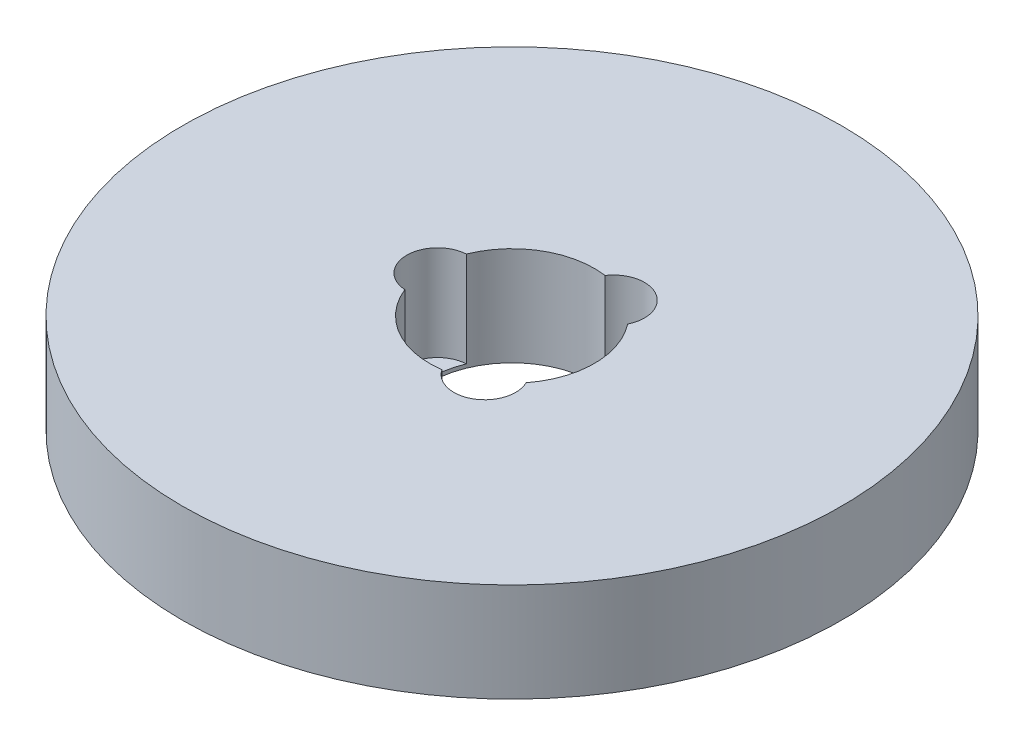
ISO-10303-21;
HEADER;
FILE_DESCRIPTION(('STEP AP214'),'2;1');
FILE_NAME('part.step','',(''),(''),'','','');
FILE_SCHEMA(('AUTOMOTIVE_DESIGN { 1 0 10303 214 1 1 1 1 }'));
ENDSEC;
DATA;
#1=APPLICATION_CONTEXT('core data for automotive mechanical design processes');
#2=APPLICATION_PROTOCOL_DEFINITION('international standard','automotive_design',2000,#1);
#3=PRODUCT_CONTEXT('',#1,'mechanical');
#4=PRODUCT('Part','Part','',(#3));
#5=PRODUCT_RELATED_PRODUCT_CATEGORY('part','',(#4));
#6=PRODUCT_DEFINITION_FORMATION('','',#4);
#7=PRODUCT_DEFINITION_CONTEXT('part definition',#1,'design');
#8=PRODUCT_DEFINITION('design','',#6,#7);
#9=PRODUCT_DEFINITION_SHAPE('','',#8);
#10=(LENGTH_UNIT() NAMED_UNIT(*) SI_UNIT(.MILLI.,.METRE.));
#11=(NAMED_UNIT(*) PLANE_ANGLE_UNIT() SI_UNIT($,.RADIAN.));
#12=(NAMED_UNIT(*) SI_UNIT($,.STERADIAN.) SOLID_ANGLE_UNIT());
#13=UNCERTAINTY_MEASURE_WITH_UNIT(LENGTH_MEASURE(1.E-05),#10,'distance_accuracy_value','');
#14=(GEOMETRIC_REPRESENTATION_CONTEXT(3) GLOBAL_UNCERTAINTY_ASSIGNED_CONTEXT((#13)) GLOBAL_UNIT_ASSIGNED_CONTEXT((#10,
#11,#12)) REPRESENTATION_CONTEXT('',''));
#15=CARTESIAN_POINT('',(0.,0.,0.));
#16=DIRECTION('',(0.,0.,1.));
#17=DIRECTION('',(1.,0.,0.));
#18=AXIS2_PLACEMENT_3D('',#15,#16,#17);
#19=CARTESIAN_POINT('',(0.,9.,0.));
#20=DIRECTION('',(0.,-1.,0.));
#21=DIRECTION('',(0.,0.,-1.));
#22=AXIS2_PLACEMENT_3D('',#19,#20,#21);
#23=CYLINDRICAL_SURFACE('',#22,30.);
#24=CARTESIAN_POINT('',(0.,9.,0.));
#25=DIRECTION('',(0.,1.,0.));
#26=DIRECTION('',(0.,0.,1.));
#27=AXIS2_PLACEMENT_3D('',#24,#25,#26);
#28=CIRCLE('',#27,30.);
#29=CARTESIAN_POINT('',(0.,9.,30.));
#30=VERTEX_POINT('',#29);
#31=EDGE_CURVE('E130',#30,#30,#28,.T.);
#32=ORIENTED_EDGE('',*,*,#31,.F.);
#33=EDGE_LOOP('',(#32));
#34=FACE_BOUND('',#33,.T.);
#35=CARTESIAN_POINT('',(0.,0.,0.));
#36=DIRECTION('',(0.,1.,0.));
#37=DIRECTION('',(0.,0.,1.));
#38=AXIS2_PLACEMENT_3D('',#35,#36,#37);
#39=CIRCLE('',#38,30.);
#40=CARTESIAN_POINT('',(0.,0.,30.));
#41=VERTEX_POINT('',#40);
#42=EDGE_CURVE('E117',#41,#41,#39,.T.);
#43=ORIENTED_EDGE('',*,*,#42,.T.);
#44=EDGE_LOOP('',(#43));
#45=FACE_BOUND('',#44,.T.);
#46=ADVANCED_FACE('F39',(#34,#45),#23,.T.);
#47=CARTESIAN_POINT('',(0.,9.,0.));
#48=DIRECTION('',(0.,1.,0.));
#49=DIRECTION('',(0.,0.,1.));
#50=AXIS2_PLACEMENT_3D('',#47,#48,#49);
#51=PLANE('',#50);
#52=CARTESIAN_POINT('',(3.3843474534861,9.,5.86186173990421));
#53=DIRECTION('',(0.,1.,0.));
#54=DIRECTION('',(0.866025403784436,0.,-0.500000000000004));
#55=AXIS2_PLACEMENT_3D('',#52,#53,#54);
#56=CIRCLE('',#55,2.81327656806787);
#57=CARTESIAN_POINT('',(1.04640352156776,9.,7.42664390354422));
#58=VERTEX_POINT('',#57);
#59=CARTESIAN_POINT('',(5.90846052454629,9.,4.61953398405923));
#60=VERTEX_POINT('',#59);
#61=EDGE_CURVE('E148',#58,#60,#56,.T.);
#62=ORIENTED_EDGE('',*,*,#61,.F.);
#63=CARTESIAN_POINT('',(0.,9.,0.));
#64=DIRECTION('',(0.,1.,0.));
#65=DIRECTION('',(0.,0.,1.));
#66=AXIS2_PLACEMENT_3D('',#63,#64,#65);
#67=CIRCLE('',#66,7.5);
#68=CARTESIAN_POINT('',(-6.95486404611399,9.,2.80710991948497));
#69=VERTEX_POINT('',#68);
#70=EDGE_CURVE('E113',#69,#58,#67,.T.);
#71=ORIENTED_EDGE('',*,*,#70,.F.);
#72=CARTESIAN_POINT('',(-6.76869490697215,9.,0.));
#73=DIRECTION('',(0.,1.,0.));
#74=DIRECTION('',(0.,0.,1.));
#75=AXIS2_PLACEMENT_3D('',#72,#73,#74);
#76=CIRCLE('',#75,2.81327656806787);
#77=CARTESIAN_POINT('',(-6.95486404611399,9.,-2.80710991948497));
#78=VERTEX_POINT('',#77);
#79=EDGE_CURVE('E125',#78,#69,#76,.T.);
#80=ORIENTED_EDGE('',*,*,#79,.F.);
#81=CARTESIAN_POINT('',(1.04640352156765,9.,-7.42664390354424));
#82=VERTEX_POINT('',#81);
#83=EDGE_CURVE('E107',#82,#78,#67,.T.);
#84=ORIENTED_EDGE('',*,*,#83,.F.);
#85=CARTESIAN_POINT('',(3.38434745348602,9.,-5.86186173990426));
#86=DIRECTION('',(0.,1.,0.));
#87=DIRECTION('',(-0.866025403784443,0.,-0.499999999999992));
#88=AXIS2_PLACEMENT_3D('',#85,#86,#87);
#89=CIRCLE('',#88,2.81327656806787);
#90=CARTESIAN_POINT('',(5.90846052454623,9.,-4.61953398405932));
#91=VERTEX_POINT('',#90);
#92=EDGE_CURVE('E95',#91,#82,#89,.T.);
#93=ORIENTED_EDGE('',*,*,#92,.F.);
#94=EDGE_CURVE('E106',#60,#91,#67,.T.);
#95=ORIENTED_EDGE('',*,*,#94,.F.);
#96=EDGE_LOOP('',(#62,#71,#80,#84,#93,#95));
#97=FACE_BOUND('',#96,.T.);
#98=ORIENTED_EDGE('',*,*,#31,.T.);
#99=EDGE_LOOP('',(#98));
#100=FACE_BOUND('',#99,.T.);
#101=ADVANCED_FACE('F102',(#97,#100),#51,.T.);
#102=CARTESIAN_POINT('',(0.,0.,0.));
#103=DIRECTION('',(0.,1.,0.));
#104=DIRECTION('',(0.,0.,1.));
#105=AXIS2_PLACEMENT_3D('',#102,#103,#104);
#106=PLANE('',#105);
#107=CARTESIAN_POINT('',(0.,0.,0.));
#108=DIRECTION('',(0.,1.,0.));
#109=DIRECTION('',(0.,0.,1.));
#110=AXIS2_PLACEMENT_3D('',#107,#108,#109);
#111=CIRCLE('',#110,7.5);
#112=CARTESIAN_POINT('',(0.,0.,7.5));
#113=VERTEX_POINT('',#112);
#114=EDGE_CURVE('E118',#113,#113,#111,.T.);
#115=ORIENTED_EDGE('',*,*,#114,.T.);
#116=EDGE_LOOP('',(#115));
#117=FACE_BOUND('',#116,.T.);
#118=ORIENTED_EDGE('',*,*,#42,.F.);
#119=EDGE_LOOP('',(#118));
#120=FACE_BOUND('',#119,.T.);
#121=ADVANCED_FACE('F161',(#117,#120),#106,.F.);
#122=CARTESIAN_POINT('',(0.,9.,0.));
#123=DIRECTION('',(0.,-1.,0.));
#124=DIRECTION('',(0.,0.,-1.));
#125=AXIS2_PLACEMENT_3D('',#122,#123,#124);
#126=CYLINDRICAL_SURFACE('',#125,7.5);
#127=DIRECTION('',(0.,1.,0.));
#128=VECTOR('',#127,1.);
#129=CARTESIAN_POINT('',(1.04640352156776,4.67171512583088,7.42664390354423));
#130=LINE('',#129,#128);
#131=CARTESIAN_POINT('',(1.04640352156776,0.343430251661754,7.42664390354422));
#132=VERTEX_POINT('',#131);
#133=EDGE_CURVE('E11',#132,#58,#130,.T.);
#134=ORIENTED_EDGE('',*,*,#133,.F.);
#135=CARTESIAN_POINT('',(0.,0.343430251661754,0.));
#136=DIRECTION('',(0.,1.,0.));
#137=DIRECTION('',(0.,0.,1.));
#138=AXIS2_PLACEMENT_3D('',#135,#136,#137);
#139=CIRCLE('',#138,7.5);
#140=CARTESIAN_POINT('',(5.90846052454629,0.343430251661754,4.61953398405923));
#141=VERTEX_POINT('',#140);
#142=EDGE_CURVE('E100',#132,#141,#139,.T.);
#143=ORIENTED_EDGE('',*,*,#142,.T.);
#144=DIRECTION('',(0.,1.,0.));
#145=VECTOR('',#144,1.);
#146=CARTESIAN_POINT('',(5.90846052454629,4.67171512583088,4.61953398405923));
#147=LINE('',#146,#145);
#148=EDGE_CURVE('E46',#60,#141,#147,.F.);
#149=ORIENTED_EDGE('',*,*,#148,.F.);
#150=ORIENTED_EDGE('',*,*,#94,.T.);
#151=DIRECTION('',(0.,1.,0.));
#152=VECTOR('',#151,1.);
#153=CARTESIAN_POINT('',(5.90846052454623,4.67171512583088,-4.61953398405932));
#154=LINE('',#153,#152);
#155=CARTESIAN_POINT('',(5.90846052454623,0.343430251661754,-4.61953398405932));
#156=VERTEX_POINT('',#155);
#157=EDGE_CURVE('E90',#156,#91,#154,.T.);
#158=ORIENTED_EDGE('',*,*,#157,.F.);
#159=CARTESIAN_POINT('',(0.,0.343430251661754,0.));
#160=DIRECTION('',(0.,1.,0.));
#161=DIRECTION('',(0.,0.,1.));
#162=AXIS2_PLACEMENT_3D('',#159,#160,#161);
#163=CIRCLE('',#162,7.5);
#164=CARTESIAN_POINT('',(1.04640352156765,0.343430251661754,-7.42664390354424));
#165=VERTEX_POINT('',#164);
#166=EDGE_CURVE('E143',#156,#165,#163,.T.);
#167=ORIENTED_EDGE('',*,*,#166,.T.);
#168=DIRECTION('',(0.,1.,0.));
#169=VECTOR('',#168,1.);
#170=CARTESIAN_POINT('',(1.04640352156765,4.67171512583088,-7.42664390354424));
#171=LINE('',#170,#169);
#172=EDGE_CURVE('E98',#82,#165,#171,.F.);
#173=ORIENTED_EDGE('',*,*,#172,.F.);
#174=ORIENTED_EDGE('',*,*,#83,.T.);
#175=DIRECTION('',(0.,1.,0.));
#176=VECTOR('',#175,1.);
#177=CARTESIAN_POINT('',(-6.95486404611399,4.67171512583088,-2.80710991948497));
#178=LINE('',#177,#176);
#179=CARTESIAN_POINT('',(-6.95486404611399,0.343430251661754,-2.80710991948497));
#180=VERTEX_POINT('',#179);
#181=EDGE_CURVE('E137',#180,#78,#178,.T.);
#182=ORIENTED_EDGE('',*,*,#181,.F.);
#183=CARTESIAN_POINT('',(0.,0.343430251661754,0.));
#184=DIRECTION('',(0.,1.,0.));
#185=DIRECTION('',(0.,0.,1.));
#186=AXIS2_PLACEMENT_3D('',#183,#184,#185);
#187=CIRCLE('',#186,7.5);
#188=CARTESIAN_POINT('',(-6.95486404611399,0.343430251661754,2.80710991948497));
#189=VERTEX_POINT('',#188);
#190=EDGE_CURVE('E128',#180,#189,#187,.T.);
#191=ORIENTED_EDGE('',*,*,#190,.T.);
#192=DIRECTION('',(0.,1.,0.));
#193=VECTOR('',#192,1.);
#194=CARTESIAN_POINT('',(-6.95486404611399,4.67171512583088,2.80710991948497));
#195=LINE('',#194,#193);
#196=EDGE_CURVE('E134',#69,#189,#195,.F.);
#197=ORIENTED_EDGE('',*,*,#196,.F.);
#198=ORIENTED_EDGE('',*,*,#70,.T.);
#199=EDGE_LOOP('',(#134,#143,#149,#150,#158,#167,#173,#174,#182,#191,#197,#198));
#200=FACE_BOUND('',#199,.T.);
#201=ORIENTED_EDGE('',*,*,#114,.F.);
#202=EDGE_LOOP('',(#201));
#203=FACE_BOUND('',#202,.T.);
#204=ADVANCED_FACE('F115',(#200,#203),#126,.F.);
#205=CARTESIAN_POINT('',(-6.76869490697215,0.343430251661754,0.));
#206=DIRECTION('',(0.,1.,0.));
#207=DIRECTION('',(0.,0.,1.));
#208=AXIS2_PLACEMENT_3D('',#205,#206,#207);
#209=CYLINDRICAL_SURFACE('',#208,2.81327656806787);
#210=ORIENTED_EDGE('',*,*,#181,.T.);
#211=ORIENTED_EDGE('',*,*,#79,.T.);
#212=ORIENTED_EDGE('',*,*,#196,.T.);
#213=CARTESIAN_POINT('',(-6.76869490697215,0.343430251661754,0.));
#214=DIRECTION('',(0.,1.,0.));
#215=DIRECTION('',(0.,0.,1.));
#216=AXIS2_PLACEMENT_3D('',#213,#214,#215);
#217=CIRCLE('',#216,2.81327656806787);
#218=EDGE_CURVE('E127',#180,#189,#217,.T.);
#219=ORIENTED_EDGE('',*,*,#218,.F.);
#220=EDGE_LOOP('',(#210,#211,#212,#219));
#221=FACE_BOUND('',#220,.T.);
#222=ADVANCED_FACE('F175',(#221),#209,.F.);
#223=CARTESIAN_POINT('',(-6.76869490697215,0.343430251661754,0.));
#224=DIRECTION('',(0.,1.,0.));
#225=DIRECTION('',(0.,0.,1.));
#226=AXIS2_PLACEMENT_3D('',#223,#224,#225);
#227=PLANE('',#226);
#228=ORIENTED_EDGE('',*,*,#218,.T.);
#229=ORIENTED_EDGE('',*,*,#190,.F.);
#230=EDGE_LOOP('',(#228,#229));
#231=FACE_BOUND('',#230,.T.);
#232=ADVANCED_FACE('F176',(#231),#227,.T.);
#233=CARTESIAN_POINT('',(3.38434745348602,0.343430251661754,-5.86186173990426));
#234=DIRECTION('',(0.,1.,0.));
#235=DIRECTION('',(0.,0.,1.));
#236=AXIS2_PLACEMENT_3D('',#233,#234,#235);
#237=CYLINDRICAL_SURFACE('',#236,2.81327656806787);
#238=ORIENTED_EDGE('',*,*,#157,.T.);
#239=ORIENTED_EDGE('',*,*,#92,.T.);
#240=ORIENTED_EDGE('',*,*,#172,.T.);
#241=CARTESIAN_POINT('',(3.38434745348602,0.343430251661754,-5.86186173990426));
#242=DIRECTION('',(0.,1.,0.));
#243=DIRECTION('',(-0.866025403784443,0.,-0.499999999999992));
#244=AXIS2_PLACEMENT_3D('',#241,#242,#243);
#245=CIRCLE('',#244,2.81327656806787);
#246=EDGE_CURVE('E56',#156,#165,#245,.T.);
#247=ORIENTED_EDGE('',*,*,#246,.F.);
#248=EDGE_LOOP('',(#238,#239,#240,#247));
#249=FACE_BOUND('',#248,.T.);
#250=ADVANCED_FACE('F93',(#249),#237,.F.);
#251=CARTESIAN_POINT('',(3.38434745348602,0.343430251661754,-5.86186173990426));
#252=DIRECTION('',(0.,1.,0.));
#253=DIRECTION('',(-0.866025403784443,0.,-0.499999999999992));
#254=AXIS2_PLACEMENT_3D('',#251,#252,#253);
#255=PLANE('',#254);
#256=ORIENTED_EDGE('',*,*,#246,.T.);
#257=ORIENTED_EDGE('',*,*,#166,.F.);
#258=EDGE_LOOP('',(#256,#257));
#259=FACE_BOUND('',#258,.T.);
#260=ADVANCED_FACE('F153',(#259),#255,.T.);
#261=CARTESIAN_POINT('',(3.3843474534861,0.343430251661754,5.86186173990421));
#262=DIRECTION('',(0.,1.,0.));
#263=DIRECTION('',(0.,0.,1.));
#264=AXIS2_PLACEMENT_3D('',#261,#262,#263);
#265=CYLINDRICAL_SURFACE('',#264,2.81327656806787);
#266=ORIENTED_EDGE('',*,*,#133,.T.);
#267=ORIENTED_EDGE('',*,*,#61,.T.);
#268=ORIENTED_EDGE('',*,*,#148,.T.);
#269=CARTESIAN_POINT('',(3.3843474534861,0.343430251661754,5.86186173990421));
#270=DIRECTION('',(0.,1.,0.));
#271=DIRECTION('',(0.866025403784436,0.,-0.500000000000004));
#272=AXIS2_PLACEMENT_3D('',#269,#270,#271);
#273=CIRCLE('',#272,2.81327656806787);
#274=EDGE_CURVE('E55',#132,#141,#273,.T.);
#275=ORIENTED_EDGE('',*,*,#274,.F.);
#276=EDGE_LOOP('',(#266,#267,#268,#275));
#277=FACE_BOUND('',#276,.T.);
#278=ADVANCED_FACE('F144',(#277),#265,.F.);
#279=CARTESIAN_POINT('',(3.3843474534861,0.343430251661754,5.86186173990421));
#280=DIRECTION('',(0.,1.,0.));
#281=DIRECTION('',(0.866025403784436,0.,-0.500000000000004));
#282=AXIS2_PLACEMENT_3D('',#279,#280,#281);
#283=PLANE('',#282);
#284=ORIENTED_EDGE('',*,*,#274,.T.);
#285=ORIENTED_EDGE('',*,*,#142,.F.);
#286=EDGE_LOOP('',(#284,#285));
#287=FACE_BOUND('',#286,.T.);
#288=ADVANCED_FACE('F150',(#287),#283,.T.);
#289=CLOSED_SHELL('',(#46,#101,#121,#204,#222,#232,#250,#260,#278,#288));
#290=MANIFOLD_SOLID_BREP('B2',#289);
#291=ADVANCED_BREP_SHAPE_REPRESENTATION('',(#18,#290),#14);
#292=SHAPE_DEFINITION_REPRESENTATION(#9,#291);
ENDSEC;
END-ISO-10303-21;
